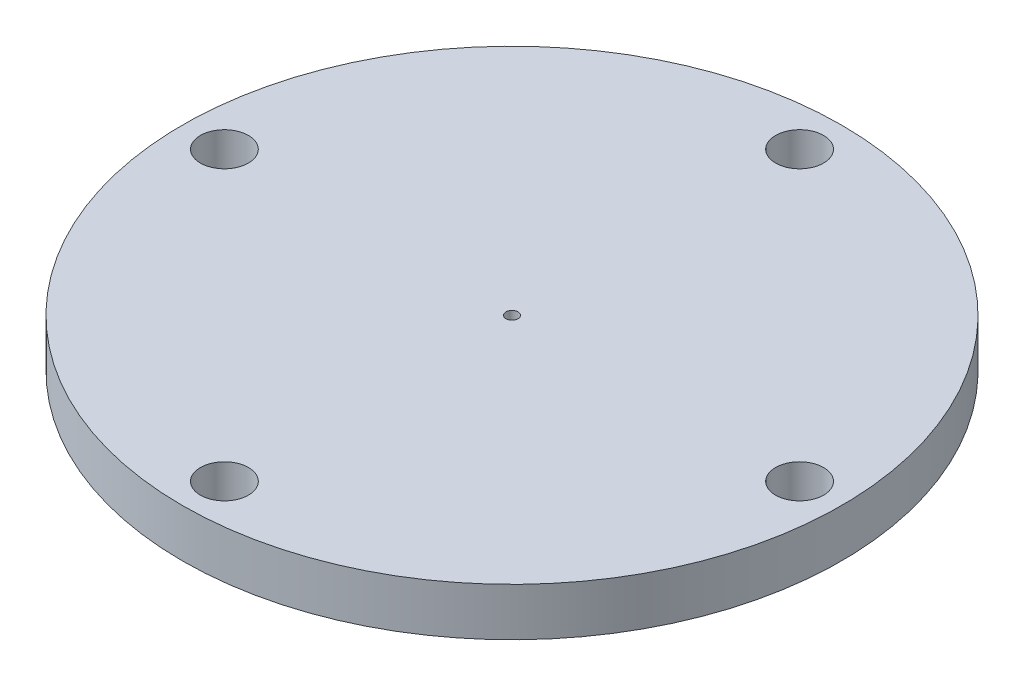
ISO-10303-21;
HEADER;
FILE_DESCRIPTION(('STEP AP214'),'2;1');
FILE_NAME('part.step','',(''),(''),'','','');
FILE_SCHEMA(('AUTOMOTIVE_DESIGN { 1 0 10303 214 1 1 1 1 }'));
ENDSEC;
DATA;
#1=APPLICATION_CONTEXT('core data for automotive mechanical design processes');
#2=APPLICATION_PROTOCOL_DEFINITION('international standard','automotive_design',2000,#1);
#3=PRODUCT_CONTEXT('',#1,'mechanical');
#4=PRODUCT('Part','Part','',(#3));
#5=PRODUCT_RELATED_PRODUCT_CATEGORY('part','',(#4));
#6=PRODUCT_DEFINITION_FORMATION('','',#4);
#7=PRODUCT_DEFINITION_CONTEXT('part definition',#1,'design');
#8=PRODUCT_DEFINITION('design','',#6,#7);
#9=PRODUCT_DEFINITION_SHAPE('','',#8);
#10=(LENGTH_UNIT() NAMED_UNIT(*) SI_UNIT(.MILLI.,.METRE.));
#11=(NAMED_UNIT(*) PLANE_ANGLE_UNIT() SI_UNIT($,.RADIAN.));
#12=(NAMED_UNIT(*) SI_UNIT($,.STERADIAN.) SOLID_ANGLE_UNIT());
#13=UNCERTAINTY_MEASURE_WITH_UNIT(LENGTH_MEASURE(1.E-05),#10,'distance_accuracy_value','');
#14=(GEOMETRIC_REPRESENTATION_CONTEXT(3) GLOBAL_UNCERTAINTY_ASSIGNED_CONTEXT((#13)) GLOBAL_UNIT_ASSIGNED_CONTEXT((#10,
#11,#12)) REPRESENTATION_CONTEXT('',''));
#15=CARTESIAN_POINT('',(0.,0.,0.));
#16=DIRECTION('',(0.,0.,1.));
#17=DIRECTION('',(1.,0.,0.));
#18=AXIS2_PLACEMENT_3D('',#15,#16,#17);
#19=CARTESIAN_POINT('',(0.,4.,0.));
#20=DIRECTION('',(0.,-1.,0.));
#21=DIRECTION('',(0.,0.,-1.));
#22=AXIS2_PLACEMENT_3D('',#19,#20,#21);
#23=CYLINDRICAL_SURFACE('',#22,27.469);
#24=CARTESIAN_POINT('',(0.,4.,0.));
#25=DIRECTION('',(0.,1.,0.));
#26=DIRECTION('',(0.,0.,1.));
#27=AXIS2_PLACEMENT_3D('',#24,#25,#26);
#28=CIRCLE('',#27,27.469);
#29=CARTESIAN_POINT('',(0.,4.,27.469));
#30=VERTEX_POINT('',#29);
#31=EDGE_CURVE('E10',#30,#30,#28,.T.);
#32=ORIENTED_EDGE('',*,*,#31,.F.);
#33=EDGE_LOOP('',(#32));
#34=FACE_BOUND('',#33,.T.);
#35=CARTESIAN_POINT('',(0.,0.,0.));
#36=DIRECTION('',(0.,1.,0.));
#37=DIRECTION('',(0.,0.,1.));
#38=AXIS2_PLACEMENT_3D('',#35,#36,#37);
#39=CIRCLE('',#38,27.469);
#40=CARTESIAN_POINT('',(0.,0.,27.469));
#41=VERTEX_POINT('',#40);
#42=EDGE_CURVE('E34',#41,#41,#39,.T.);
#43=ORIENTED_EDGE('',*,*,#42,.T.);
#44=EDGE_LOOP('',(#43));
#45=FACE_BOUND('',#44,.T.);
#46=ADVANCED_FACE('F31',(#34,#45),#23,.T.);
#47=CARTESIAN_POINT('',(0.,4.,0.));
#48=DIRECTION('',(0.,1.,0.));
#49=DIRECTION('',(0.,0.,1.));
#50=AXIS2_PLACEMENT_3D('',#47,#48,#49);
#51=PLANE('',#50);
#52=CARTESIAN_POINT('',(0.,4.,0.));
#53=DIRECTION('',(0.,1.,0.));
#54=DIRECTION('',(0.,0.,1.));
#55=AXIS2_PLACEMENT_3D('',#52,#53,#54);
#56=CIRCLE('',#55,0.5);
#57=CARTESIAN_POINT('',(0.,4.,0.5));
#58=VERTEX_POINT('',#57);
#59=EDGE_CURVE('E47',#58,#58,#56,.T.);
#60=ORIENTED_EDGE('',*,*,#59,.F.);
#61=EDGE_LOOP('',(#60));
#62=FACE_BOUND('',#61,.T.);
#63=CARTESIAN_POINT('',(-23.971,4.,0.));
#64=DIRECTION('',(0.,1.,0.));
#65=DIRECTION('',(0.,0.,1.));
#66=AXIS2_PLACEMENT_3D('',#63,#64,#65);
#67=CIRCLE('',#66,2.);
#68=CARTESIAN_POINT('',(-23.971,4.,2.));
#69=VERTEX_POINT('',#68);
#70=EDGE_CURVE('E62',#69,#69,#67,.T.);
#71=ORIENTED_EDGE('',*,*,#70,.F.);
#72=EDGE_LOOP('',(#71));
#73=FACE_BOUND('',#72,.T.);
#74=CARTESIAN_POINT('',(0.,4.,-23.971));
#75=DIRECTION('',(0.,1.,0.));
#76=DIRECTION('',(0.,0.,1.));
#77=AXIS2_PLACEMENT_3D('',#74,#75,#76);
#78=CIRCLE('',#77,2.);
#79=CARTESIAN_POINT('',(0.,4.,-21.971));
#80=VERTEX_POINT('',#79);
#81=EDGE_CURVE('E56',#80,#80,#78,.T.);
#82=ORIENTED_EDGE('',*,*,#81,.F.);
#83=EDGE_LOOP('',(#82));
#84=FACE_BOUND('',#83,.T.);
#85=CARTESIAN_POINT('',(23.971,4.,0.));
#86=DIRECTION('',(0.,1.,0.));
#87=DIRECTION('',(0.,0.,1.));
#88=AXIS2_PLACEMENT_3D('',#85,#86,#87);
#89=CIRCLE('',#88,2.);
#90=CARTESIAN_POINT('',(23.971,4.,2.));
#91=VERTEX_POINT('',#90);
#92=EDGE_CURVE('E50',#91,#91,#89,.T.);
#93=ORIENTED_EDGE('',*,*,#92,.F.);
#94=EDGE_LOOP('',(#93));
#95=FACE_BOUND('',#94,.T.);
#96=CARTESIAN_POINT('',(0.,4.,23.971));
#97=DIRECTION('',(0.,1.,0.));
#98=DIRECTION('',(0.,0.,1.));
#99=AXIS2_PLACEMENT_3D('',#96,#97,#98);
#100=CIRCLE('',#99,2.);
#101=CARTESIAN_POINT('',(0.,4.,25.971));
#102=VERTEX_POINT('',#101);
#103=EDGE_CURVE('E43',#102,#102,#100,.T.);
#104=ORIENTED_EDGE('',*,*,#103,.F.);
#105=EDGE_LOOP('',(#104));
#106=FACE_BOUND('',#105,.T.);
#107=ORIENTED_EDGE('',*,*,#31,.T.);
#108=EDGE_LOOP('',(#107));
#109=FACE_BOUND('',#108,.T.);
#110=ADVANCED_FACE('F88',(#62,#73,#84,#95,#106,#109),#51,.T.);
#111=CARTESIAN_POINT('',(0.,0.,0.));
#112=DIRECTION('',(0.,1.,0.));
#113=DIRECTION('',(0.,0.,1.));
#114=AXIS2_PLACEMENT_3D('',#111,#112,#113);
#115=PLANE('',#114);
#116=CARTESIAN_POINT('',(0.,0.,0.));
#117=DIRECTION('',(0.,1.,0.));
#118=DIRECTION('',(0.,0.,1.));
#119=AXIS2_PLACEMENT_3D('',#116,#117,#118);
#120=CIRCLE('',#119,0.5);
#121=CARTESIAN_POINT('',(0.,0.,0.5));
#122=VERTEX_POINT('',#121);
#123=EDGE_CURVE('E69',#122,#122,#120,.T.);
#124=ORIENTED_EDGE('',*,*,#123,.T.);
#125=EDGE_LOOP('',(#124));
#126=FACE_BOUND('',#125,.T.);
#127=CARTESIAN_POINT('',(-23.971,0.,0.));
#128=DIRECTION('',(0.,1.,0.));
#129=DIRECTION('',(0.,0.,1.));
#130=AXIS2_PLACEMENT_3D('',#127,#128,#129);
#131=CIRCLE('',#130,2.);
#132=CARTESIAN_POINT('',(-23.971,0.,2.));
#133=VERTEX_POINT('',#132);
#134=EDGE_CURVE('E41',#133,#133,#131,.T.);
#135=ORIENTED_EDGE('',*,*,#134,.T.);
#136=EDGE_LOOP('',(#135));
#137=FACE_BOUND('',#136,.T.);
#138=CARTESIAN_POINT('',(0.,0.,-23.971));
#139=DIRECTION('',(0.,1.,0.));
#140=DIRECTION('',(0.,0.,1.));
#141=AXIS2_PLACEMENT_3D('',#138,#139,#140);
#142=CIRCLE('',#141,2.);
#143=CARTESIAN_POINT('',(0.,0.,-21.971));
#144=VERTEX_POINT('',#143);
#145=EDGE_CURVE('E59',#144,#144,#142,.T.);
#146=ORIENTED_EDGE('',*,*,#145,.T.);
#147=EDGE_LOOP('',(#146));
#148=FACE_BOUND('',#147,.T.);
#149=CARTESIAN_POINT('',(23.971,0.,0.));
#150=DIRECTION('',(0.,1.,0.));
#151=DIRECTION('',(0.,0.,1.));
#152=AXIS2_PLACEMENT_3D('',#149,#150,#151);
#153=CIRCLE('',#152,2.);
#154=CARTESIAN_POINT('',(23.971,0.,2.));
#155=VERTEX_POINT('',#154);
#156=EDGE_CURVE('E53',#155,#155,#153,.T.);
#157=ORIENTED_EDGE('',*,*,#156,.T.);
#158=EDGE_LOOP('',(#157));
#159=FACE_BOUND('',#158,.T.);
#160=CARTESIAN_POINT('',(0.,0.,23.971));
#161=DIRECTION('',(0.,1.,0.));
#162=DIRECTION('',(0.,0.,1.));
#163=AXIS2_PLACEMENT_3D('',#160,#161,#162);
#164=CIRCLE('',#163,2.);
#165=CARTESIAN_POINT('',(0.,0.,25.971));
#166=VERTEX_POINT('',#165);
#167=EDGE_CURVE('E46',#166,#166,#164,.T.);
#168=ORIENTED_EDGE('',*,*,#167,.T.);
#169=EDGE_LOOP('',(#168));
#170=FACE_BOUND('',#169,.T.);
#171=ORIENTED_EDGE('',*,*,#42,.F.);
#172=EDGE_LOOP('',(#171));
#173=FACE_BOUND('',#172,.T.);
#174=ADVANCED_FACE('F73',(#126,#137,#148,#159,#170,#173),#115,.F.);
#175=CARTESIAN_POINT('',(0.,0.,23.971));
#176=DIRECTION('',(0.,1.,0.));
#177=DIRECTION('',(0.,0.,1.));
#178=AXIS2_PLACEMENT_3D('',#175,#176,#177);
#179=CYLINDRICAL_SURFACE('',#178,2.);
#180=ORIENTED_EDGE('',*,*,#167,.F.);
#181=EDGE_LOOP('',(#180));
#182=FACE_BOUND('',#181,.T.);
#183=ORIENTED_EDGE('',*,*,#103,.T.);
#184=EDGE_LOOP('',(#183));
#185=FACE_BOUND('',#184,.T.);
#186=ADVANCED_FACE('F100',(#182,#185),#179,.F.);
#187=CARTESIAN_POINT('',(23.971,0.,0.));
#188=DIRECTION('',(0.,1.,0.));
#189=DIRECTION('',(0.,0.,1.));
#190=AXIS2_PLACEMENT_3D('',#187,#188,#189);
#191=CYLINDRICAL_SURFACE('',#190,2.);
#192=ORIENTED_EDGE('',*,*,#156,.F.);
#193=EDGE_LOOP('',(#192));
#194=FACE_BOUND('',#193,.T.);
#195=ORIENTED_EDGE('',*,*,#92,.T.);
#196=EDGE_LOOP('',(#195));
#197=FACE_BOUND('',#196,.T.);
#198=ADVANCED_FACE('F104',(#194,#197),#191,.F.);
#199=CARTESIAN_POINT('',(0.,0.,-23.971));
#200=DIRECTION('',(0.,1.,0.));
#201=DIRECTION('',(0.,0.,1.));
#202=AXIS2_PLACEMENT_3D('',#199,#200,#201);
#203=CYLINDRICAL_SURFACE('',#202,2.);
#204=ORIENTED_EDGE('',*,*,#145,.F.);
#205=EDGE_LOOP('',(#204));
#206=FACE_BOUND('',#205,.T.);
#207=ORIENTED_EDGE('',*,*,#81,.T.);
#208=EDGE_LOOP('',(#207));
#209=FACE_BOUND('',#208,.T.);
#210=ADVANCED_FACE('F84',(#206,#209),#203,.F.);
#211=CARTESIAN_POINT('',(-23.971,0.,0.));
#212=DIRECTION('',(0.,1.,0.));
#213=DIRECTION('',(0.,0.,1.));
#214=AXIS2_PLACEMENT_3D('',#211,#212,#213);
#215=CYLINDRICAL_SURFACE('',#214,2.);
#216=ORIENTED_EDGE('',*,*,#134,.F.);
#217=EDGE_LOOP('',(#216));
#218=FACE_BOUND('',#217,.T.);
#219=ORIENTED_EDGE('',*,*,#70,.T.);
#220=EDGE_LOOP('',(#219));
#221=FACE_BOUND('',#220,.T.);
#222=ADVANCED_FACE('F78',(#218,#221),#215,.F.);
#223=CARTESIAN_POINT('',(0.,0.,0.));
#224=DIRECTION('',(0.,1.,0.));
#225=DIRECTION('',(0.,0.,1.));
#226=AXIS2_PLACEMENT_3D('',#223,#224,#225);
#227=CYLINDRICAL_SURFACE('',#226,0.5);
#228=ORIENTED_EDGE('',*,*,#59,.T.);
#229=EDGE_LOOP('',(#228));
#230=FACE_BOUND('',#229,.T.);
#231=ORIENTED_EDGE('',*,*,#123,.F.);
#232=EDGE_LOOP('',(#231));
#233=FACE_BOUND('',#232,.T.);
#234=ADVANCED_FACE('F76',(#230,#233),#227,.F.);
#235=CLOSED_SHELL('',(#46,#110,#174,#186,#198,#210,#222,#234));
#236=MANIFOLD_SOLID_BREP('B2',#235);
#237=ADVANCED_BREP_SHAPE_REPRESENTATION('',(#18,#236),#14);
#238=SHAPE_DEFINITION_REPRESENTATION(#9,#237);
ENDSEC;
END-ISO-10303-21;
